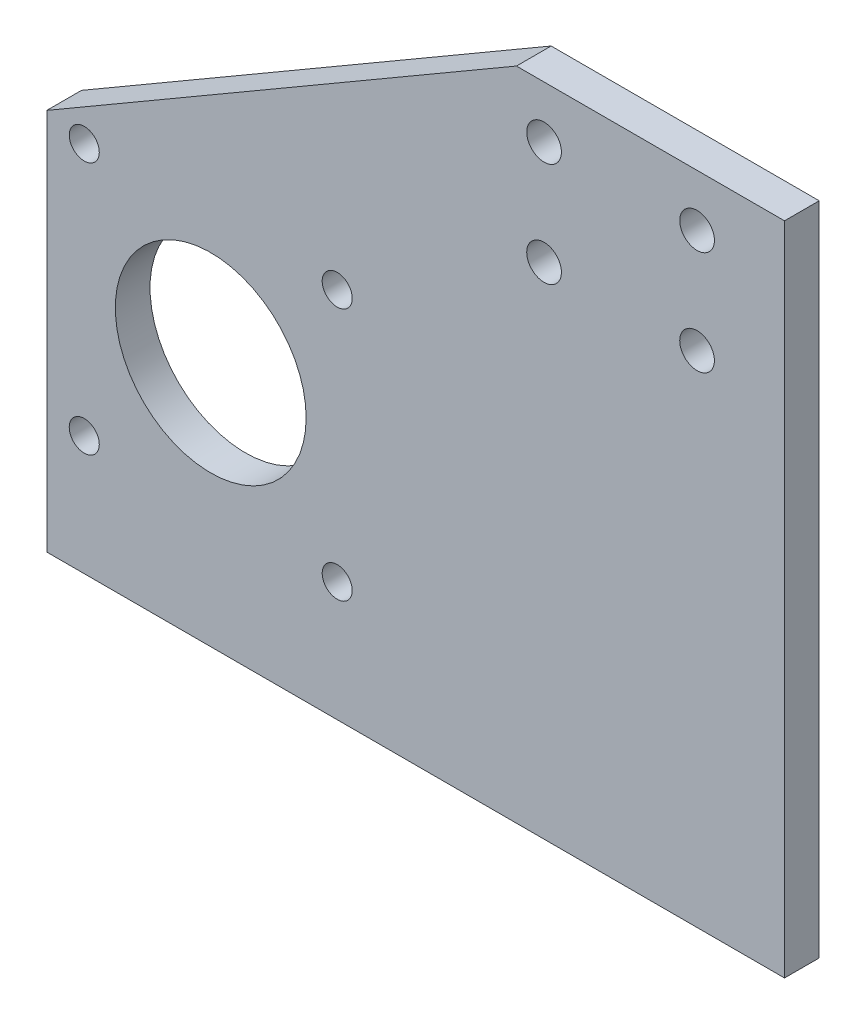
ISO-10303-21;
HEADER;
FILE_DESCRIPTION(('STEP AP214'),'2;1');
FILE_NAME('part.step','',(''),(''),'','','');
FILE_SCHEMA(('AUTOMOTIVE_DESIGN { 1 0 10303 214 1 1 1 1 }'));
ENDSEC;
DATA;
#1=APPLICATION_CONTEXT('core data for automotive mechanical design processes');
#2=APPLICATION_PROTOCOL_DEFINITION('international standard','automotive_design',2000,#1);
#3=PRODUCT_CONTEXT('',#1,'mechanical');
#4=PRODUCT('Part','Part','',(#3));
#5=PRODUCT_RELATED_PRODUCT_CATEGORY('part','',(#4));
#6=PRODUCT_DEFINITION_FORMATION('','',#4);
#7=PRODUCT_DEFINITION_CONTEXT('part definition',#1,'design');
#8=PRODUCT_DEFINITION('design','',#6,#7);
#9=PRODUCT_DEFINITION_SHAPE('','',#8);
#10=(LENGTH_UNIT() NAMED_UNIT(*) SI_UNIT(.MILLI.,.METRE.));
#11=(NAMED_UNIT(*) PLANE_ANGLE_UNIT() SI_UNIT($,.RADIAN.));
#12=(NAMED_UNIT(*) SI_UNIT($,.STERADIAN.) SOLID_ANGLE_UNIT());
#13=UNCERTAINTY_MEASURE_WITH_UNIT(LENGTH_MEASURE(1.E-05),#10,'distance_accuracy_value','');
#14=(GEOMETRIC_REPRESENTATION_CONTEXT(3) GLOBAL_UNCERTAINTY_ASSIGNED_CONTEXT((#13)) GLOBAL_UNIT_ASSIGNED_CONTEXT((#10,
#11,#12)) REPRESENTATION_CONTEXT('',''));
#15=CARTESIAN_POINT('',(0.,0.,0.));
#16=DIRECTION('',(0.,0.,1.));
#17=DIRECTION('',(1.,0.,0.));
#18=AXIS2_PLACEMENT_3D('',#15,#16,#17);
#19=CARTESIAN_POINT('',(0.,0.,6.35));
#20=DIRECTION('',(0.,0.,1.));
#21=DIRECTION('',(1.,0.,0.));
#22=AXIS2_PLACEMENT_3D('',#19,#20,#21);
#23=PLANE('',#22);
#24=CARTESIAN_POINT('',(-105.,45.,6.35));
#25=DIRECTION('',(0.,0.,1.));
#26=DIRECTION('',(1.,0.,0.));
#27=AXIS2_PLACEMENT_3D('',#24,#25,#26);
#28=CIRCLE('',#27,17.4625);
#29=CARTESIAN_POINT('',(-87.5375,45.,6.35));
#30=VERTEX_POINT('',#29);
#31=EDGE_CURVE('E285',#30,#30,#28,.T.);
#32=ORIENTED_EDGE('',*,*,#31,.F.);
#33=EDGE_LOOP('',(#32));
#34=FACE_BOUND('',#33,.T.);
#35=CARTESIAN_POINT('',(-81.855,68.15,6.35));
#36=DIRECTION('',(0.,0.,1.));
#37=DIRECTION('',(-1.,0.,0.));
#38=AXIS2_PLACEMENT_3D('',#35,#36,#37);
#39=CIRCLE('',#38,2.75000000000001);
#40=CARTESIAN_POINT('',(-84.605,68.15,6.35));
#41=VERTEX_POINT('',#40);
#42=EDGE_CURVE('E286',#41,#41,#39,.T.);
#43=ORIENTED_EDGE('',*,*,#42,.F.);
#44=EDGE_LOOP('',(#43));
#45=FACE_BOUND('',#44,.T.);
#46=CARTESIAN_POINT('',(-81.855,21.85,6.35));
#47=DIRECTION('',(0.,0.,1.));
#48=DIRECTION('',(1.,0.,0.));
#49=AXIS2_PLACEMENT_3D('',#46,#47,#48);
#50=CIRCLE('',#49,2.75000000000001);
#51=CARTESIAN_POINT('',(-79.105,21.85,6.35));
#52=VERTEX_POINT('',#51);
#53=EDGE_CURVE('E289',#52,#52,#50,.T.);
#54=ORIENTED_EDGE('',*,*,#53,.F.);
#55=EDGE_LOOP('',(#54));
#56=FACE_BOUND('',#55,.T.);
#57=CARTESIAN_POINT('',(-128.145,21.85,6.35));
#58=DIRECTION('',(0.,0.,1.));
#59=DIRECTION('',(-1.,0.,0.));
#60=AXIS2_PLACEMENT_3D('',#57,#58,#59);
#61=CIRCLE('',#60,2.75000000000001);
#62=CARTESIAN_POINT('',(-130.895,21.85,6.35));
#63=VERTEX_POINT('',#62);
#64=EDGE_CURVE('E293',#63,#63,#61,.T.);
#65=ORIENTED_EDGE('',*,*,#64,.F.);
#66=EDGE_LOOP('',(#65));
#67=FACE_BOUND('',#66,.T.);
#68=CARTESIAN_POINT('',(-128.145,68.15,6.35));
#69=DIRECTION('',(0.,0.,1.));
#70=DIRECTION('',(1.,0.,0.));
#71=AXIS2_PLACEMENT_3D('',#68,#69,#70);
#72=CIRCLE('',#71,2.75000000000001);
#73=CARTESIAN_POINT('',(-125.395,68.15,6.35));
#74=VERTEX_POINT('',#73);
#75=EDGE_CURVE('E130',#74,#74,#72,.T.);
#76=ORIENTED_EDGE('',*,*,#75,.F.);
#77=EDGE_LOOP('',(#76));
#78=FACE_BOUND('',#77,.T.);
#79=CARTESIAN_POINT('',(-16.,91.425,6.35));
#80=DIRECTION('',(0.,0.,1.));
#81=DIRECTION('',(-1.,0.,0.));
#82=AXIS2_PLACEMENT_3D('',#79,#80,#81);
#83=CIRCLE('',#82,3.175);
#84=CARTESIAN_POINT('',(-19.175,91.425,6.35));
#85=VERTEX_POINT('',#84);
#86=EDGE_CURVE('E153',#85,#85,#83,.T.);
#87=ORIENTED_EDGE('',*,*,#86,.F.);
#88=EDGE_LOOP('',(#87));
#89=FACE_BOUND('',#88,.T.);
#90=CARTESIAN_POINT('',(-44.,110.475,6.35));
#91=DIRECTION('',(0.,0.,1.));
#92=DIRECTION('',(1.,0.,0.));
#93=AXIS2_PLACEMENT_3D('',#90,#91,#92);
#94=CIRCLE('',#93,3.175);
#95=CARTESIAN_POINT('',(-40.825,110.475,6.35));
#96=VERTEX_POINT('',#95);
#97=EDGE_CURVE('E117',#96,#96,#94,.T.);
#98=ORIENTED_EDGE('',*,*,#97,.F.);
#99=EDGE_LOOP('',(#98));
#100=FACE_BOUND('',#99,.T.);
#101=DIRECTION('',(0.,1.,0.));
#102=VECTOR('',#101,1.);
#103=CARTESIAN_POINT('',(0.,0.,6.35));
#104=LINE('',#103,#102);
#105=CARTESIAN_POINT('',(0.,0.,6.35));
#106=VERTEX_POINT('',#105);
#107=CARTESIAN_POINT('',(0.,120.,6.35));
#108=VERTEX_POINT('',#107);
#109=EDGE_CURVE('E122',#106,#108,#104,.T.);
#110=ORIENTED_EDGE('',*,*,#109,.T.);
#111=DIRECTION('',(-1.,0.,0.));
#112=VECTOR('',#111,1.);
#113=CARTESIAN_POINT('',(0.,120.,6.35));
#114=LINE('',#113,#112);
#115=CARTESIAN_POINT('',(-49.0560754427998,120.,6.35));
#116=VERTEX_POINT('',#115);
#117=EDGE_CURVE('E89',#108,#116,#114,.T.);
#118=ORIENTED_EDGE('',*,*,#117,.T.);
#119=DIRECTION('',(-0.864364678199632,-0.502865492036236,0.));
#120=VECTOR('',#119,1.);
#121=CARTESIAN_POINT('',(-135.,70.,6.35));
#122=LINE('',#121,#120);
#123=CARTESIAN_POINT('',(-135.,70.,6.35));
#124=VERTEX_POINT('',#123);
#125=EDGE_CURVE('E93',#116,#124,#122,.T.);
#126=ORIENTED_EDGE('',*,*,#125,.T.);
#127=DIRECTION('',(0.,-1.,0.));
#128=VECTOR('',#127,1.);
#129=CARTESIAN_POINT('',(-135.,0.,6.35));
#130=LINE('',#129,#128);
#131=CARTESIAN_POINT('',(-135.,0.,6.35));
#132=VERTEX_POINT('',#131);
#133=EDGE_CURVE('E97',#124,#132,#130,.T.);
#134=ORIENTED_EDGE('',*,*,#133,.T.);
#135=DIRECTION('',(1.,0.,0.));
#136=VECTOR('',#135,1.);
#137=CARTESIAN_POINT('',(0.,0.,6.35));
#138=LINE('',#137,#136);
#139=EDGE_CURVE('E55',#132,#106,#138,.T.);
#140=ORIENTED_EDGE('',*,*,#139,.T.);
#141=EDGE_LOOP('',(#110,#118,#126,#134,#140));
#142=FACE_BOUND('',#141,.T.);
#143=CARTESIAN_POINT('',(-16.,110.475,6.35));
#144=DIRECTION('',(0.,0.,1.));
#145=DIRECTION('',(1.,0.,0.));
#146=AXIS2_PLACEMENT_3D('',#143,#144,#145);
#147=CIRCLE('',#146,3.175);
#148=CARTESIAN_POINT('',(-12.825,110.475,6.35));
#149=VERTEX_POINT('',#148);
#150=EDGE_CURVE('E159',#149,#149,#147,.T.);
#151=ORIENTED_EDGE('',*,*,#150,.F.);
#152=EDGE_LOOP('',(#151));
#153=FACE_BOUND('',#152,.T.);
#154=CARTESIAN_POINT('',(-44.,91.425,6.35));
#155=DIRECTION('',(0.,0.,1.));
#156=DIRECTION('',(-1.,0.,0.));
#157=AXIS2_PLACEMENT_3D('',#154,#155,#156);
#158=CIRCLE('',#157,3.175);
#159=CARTESIAN_POINT('',(-47.175,91.425,6.35));
#160=VERTEX_POINT('',#159);
#161=EDGE_CURVE('E144',#160,#160,#158,.T.);
#162=ORIENTED_EDGE('',*,*,#161,.F.);
#163=EDGE_LOOP('',(#162));
#164=FACE_BOUND('',#163,.T.);
#165=ADVANCED_FACE('F36',(#34,#45,#56,#67,#78,#89,#100,#142,#153,#164),#23,.T.);
#166=CARTESIAN_POINT('',(0.,0.,0.));
#167=DIRECTION('',(0.,0.,1.));
#168=DIRECTION('',(1.,0.,0.));
#169=AXIS2_PLACEMENT_3D('',#166,#167,#168);
#170=PLANE('',#169);
#171=CARTESIAN_POINT('',(-105.,45.,0.));
#172=DIRECTION('',(0.,0.,1.));
#173=DIRECTION('',(1.,0.,0.));
#174=AXIS2_PLACEMENT_3D('',#171,#172,#173);
#175=CIRCLE('',#174,17.4625);
#176=CARTESIAN_POINT('',(-87.5375,45.,0.));
#177=VERTEX_POINT('',#176);
#178=EDGE_CURVE('E40',#177,#177,#175,.T.);
#179=ORIENTED_EDGE('',*,*,#178,.T.);
#180=EDGE_LOOP('',(#179));
#181=FACE_BOUND('',#180,.T.);
#182=CARTESIAN_POINT('',(-81.855,68.15,0.));
#183=DIRECTION('',(0.,0.,1.));
#184=DIRECTION('',(1.,0.,0.));
#185=AXIS2_PLACEMENT_3D('',#182,#183,#184);
#186=CIRCLE('',#185,2.75000000000001);
#187=CARTESIAN_POINT('',(-79.105,68.15,0.));
#188=VERTEX_POINT('',#187);
#189=EDGE_CURVE('E135',#188,#188,#186,.T.);
#190=ORIENTED_EDGE('',*,*,#189,.T.);
#191=EDGE_LOOP('',(#190));
#192=FACE_BOUND('',#191,.T.);
#193=CARTESIAN_POINT('',(-81.855,21.85,0.));
#194=DIRECTION('',(0.,0.,1.));
#195=DIRECTION('',(1.,0.,0.));
#196=AXIS2_PLACEMENT_3D('',#193,#194,#195);
#197=CIRCLE('',#196,2.75000000000001);
#198=CARTESIAN_POINT('',(-79.105,21.85,0.));
#199=VERTEX_POINT('',#198);
#200=EDGE_CURVE('E133',#199,#199,#197,.T.);
#201=ORIENTED_EDGE('',*,*,#200,.T.);
#202=EDGE_LOOP('',(#201));
#203=FACE_BOUND('',#202,.T.);
#204=CARTESIAN_POINT('',(-128.145,21.85,0.));
#205=DIRECTION('',(0.,0.,1.));
#206=DIRECTION('',(1.,0.,0.));
#207=AXIS2_PLACEMENT_3D('',#204,#205,#206);
#208=CIRCLE('',#207,2.75000000000001);
#209=CARTESIAN_POINT('',(-125.395,21.85,0.));
#210=VERTEX_POINT('',#209);
#211=EDGE_CURVE('E129',#210,#210,#208,.T.);
#212=ORIENTED_EDGE('',*,*,#211,.T.);
#213=EDGE_LOOP('',(#212));
#214=FACE_BOUND('',#213,.T.);
#215=CARTESIAN_POINT('',(-128.145,68.15,0.));
#216=DIRECTION('',(0.,0.,1.));
#217=DIRECTION('',(1.,0.,0.));
#218=AXIS2_PLACEMENT_3D('',#215,#216,#217);
#219=CIRCLE('',#218,2.75000000000001);
#220=CARTESIAN_POINT('',(-125.395,68.15,0.));
#221=VERTEX_POINT('',#220);
#222=EDGE_CURVE('E126',#221,#221,#219,.T.);
#223=ORIENTED_EDGE('',*,*,#222,.T.);
#224=EDGE_LOOP('',(#223));
#225=FACE_BOUND('',#224,.T.);
#226=DIRECTION('',(0.,1.,0.));
#227=VECTOR('',#226,1.);
#228=CARTESIAN_POINT('',(0.,0.,0.));
#229=LINE('',#228,#227);
#230=CARTESIAN_POINT('',(0.,0.,0.));
#231=VERTEX_POINT('',#230);
#232=CARTESIAN_POINT('',(0.,120.,0.));
#233=VERTEX_POINT('',#232);
#234=EDGE_CURVE('E113',#231,#233,#229,.T.);
#235=ORIENTED_EDGE('',*,*,#234,.F.);
#236=DIRECTION('',(1.,0.,0.));
#237=VECTOR('',#236,1.);
#238=CARTESIAN_POINT('',(0.,0.,0.));
#239=LINE('',#238,#237);
#240=CARTESIAN_POINT('',(-135.,0.,0.));
#241=VERTEX_POINT('',#240);
#242=EDGE_CURVE('E81',#241,#231,#239,.T.);
#243=ORIENTED_EDGE('',*,*,#242,.F.);
#244=DIRECTION('',(0.,-1.,0.));
#245=VECTOR('',#244,1.);
#246=CARTESIAN_POINT('',(-135.,0.,0.));
#247=LINE('',#246,#245);
#248=CARTESIAN_POINT('',(-135.,70.,0.));
#249=VERTEX_POINT('',#248);
#250=EDGE_CURVE('E75',#249,#241,#247,.T.);
#251=ORIENTED_EDGE('',*,*,#250,.F.);
#252=DIRECTION('',(-0.864364678199632,-0.502865492036236,0.));
#253=VECTOR('',#252,1.);
#254=CARTESIAN_POINT('',(-135.,70.,0.));
#255=LINE('',#254,#253);
#256=CARTESIAN_POINT('',(-49.0560754427998,120.,0.));
#257=VERTEX_POINT('',#256);
#258=EDGE_CURVE('E104',#257,#249,#255,.T.);
#259=ORIENTED_EDGE('',*,*,#258,.F.);
#260=DIRECTION('',(-1.,0.,0.));
#261=VECTOR('',#260,1.);
#262=CARTESIAN_POINT('',(0.,120.,0.));
#263=LINE('',#262,#261);
#264=EDGE_CURVE('E116',#233,#257,#263,.T.);
#265=ORIENTED_EDGE('',*,*,#264,.F.);
#266=EDGE_LOOP('',(#235,#243,#251,#259,#265));
#267=FACE_BOUND('',#266,.T.);
#268=CARTESIAN_POINT('',(-44.,110.475,0.));
#269=DIRECTION('',(0.,0.,1.));
#270=DIRECTION('',(1.,0.,0.));
#271=AXIS2_PLACEMENT_3D('',#268,#269,#270);
#272=CIRCLE('',#271,3.175);
#273=CARTESIAN_POINT('',(-40.825,110.475,0.));
#274=VERTEX_POINT('',#273);
#275=EDGE_CURVE('E162',#274,#274,#272,.T.);
#276=ORIENTED_EDGE('',*,*,#275,.T.);
#277=EDGE_LOOP('',(#276));
#278=FACE_BOUND('',#277,.T.);
#279=CARTESIAN_POINT('',(-16.,110.475,0.));
#280=DIRECTION('',(0.,0.,1.));
#281=DIRECTION('',(1.,0.,0.));
#282=AXIS2_PLACEMENT_3D('',#279,#280,#281);
#283=CIRCLE('',#282,3.175);
#284=CARTESIAN_POINT('',(-12.825,110.475,0.));
#285=VERTEX_POINT('',#284);
#286=EDGE_CURVE('E156',#285,#285,#283,.T.);
#287=ORIENTED_EDGE('',*,*,#286,.T.);
#288=EDGE_LOOP('',(#287));
#289=FACE_BOUND('',#288,.T.);
#290=CARTESIAN_POINT('',(-16.,91.425,0.));
#291=DIRECTION('',(0.,0.,1.));
#292=DIRECTION('',(-1.,0.,0.));
#293=AXIS2_PLACEMENT_3D('',#290,#291,#292);
#294=CIRCLE('',#293,3.175);
#295=CARTESIAN_POINT('',(-19.175,91.425,0.));
#296=VERTEX_POINT('',#295);
#297=EDGE_CURVE('E149',#296,#296,#294,.T.);
#298=ORIENTED_EDGE('',*,*,#297,.T.);
#299=EDGE_LOOP('',(#298));
#300=FACE_BOUND('',#299,.T.);
#301=CARTESIAN_POINT('',(-44.,91.425,0.));
#302=DIRECTION('',(0.,0.,1.));
#303=DIRECTION('',(-1.,0.,0.));
#304=AXIS2_PLACEMENT_3D('',#301,#302,#303);
#305=CIRCLE('',#304,3.175);
#306=CARTESIAN_POINT('',(-47.175,91.425,0.));
#307=VERTEX_POINT('',#306);
#308=EDGE_CURVE('E140',#307,#307,#305,.T.);
#309=ORIENTED_EDGE('',*,*,#308,.T.);
#310=EDGE_LOOP('',(#309));
#311=FACE_BOUND('',#310,.T.);
#312=ADVANCED_FACE('F175',(#181,#192,#203,#214,#225,#267,#278,#289,#300,#311),#170,.F.);
#313=CARTESIAN_POINT('',(0.,0.,6.35));
#314=DIRECTION('',(-1.,0.,0.));
#315=DIRECTION('',(0.,0.,1.));
#316=AXIS2_PLACEMENT_3D('',#313,#314,#315);
#317=PLANE('',#316);
#318=ORIENTED_EDGE('',*,*,#234,.T.);
#319=DIRECTION('',(0.,0.,-1.));
#320=VECTOR('',#319,1.);
#321=CARTESIAN_POINT('',(0.,120.,6.35));
#322=LINE('',#321,#320);
#323=EDGE_CURVE('E11',#108,#233,#322,.T.);
#324=ORIENTED_EDGE('',*,*,#323,.F.);
#325=ORIENTED_EDGE('',*,*,#109,.F.);
#326=DIRECTION('',(0.,0.,-1.));
#327=VECTOR('',#326,1.);
#328=CARTESIAN_POINT('',(0.,0.,6.35));
#329=LINE('',#328,#327);
#330=EDGE_CURVE('E109',#106,#231,#329,.T.);
#331=ORIENTED_EDGE('',*,*,#330,.T.);
#332=EDGE_LOOP('',(#318,#324,#325,#331));
#333=FACE_BOUND('',#332,.T.);
#334=ADVANCED_FACE('F38',(#333),#317,.F.);
#335=CARTESIAN_POINT('',(0.,120.,6.35));
#336=DIRECTION('',(0.,-1.,0.));
#337=DIRECTION('',(0.,0.,-1.));
#338=AXIS2_PLACEMENT_3D('',#335,#336,#337);
#339=PLANE('',#338);
#340=ORIENTED_EDGE('',*,*,#264,.T.);
#341=DIRECTION('',(0.,0.,-1.));
#342=VECTOR('',#341,1.);
#343=CARTESIAN_POINT('',(-49.0560754427998,120.,6.35));
#344=LINE('',#343,#342);
#345=EDGE_CURVE('E46',#116,#257,#344,.T.);
#346=ORIENTED_EDGE('',*,*,#345,.F.);
#347=ORIENTED_EDGE('',*,*,#117,.F.);
#348=ORIENTED_EDGE('',*,*,#323,.T.);
#349=EDGE_LOOP('',(#340,#346,#347,#348));
#350=FACE_BOUND('',#349,.T.);
#351=ADVANCED_FACE('F173',(#350),#339,.F.);
#352=CARTESIAN_POINT('',(-135.,70.,6.35));
#353=DIRECTION('',(0.502865492036236,-0.864364678199632,0.));
#354=DIRECTION('',(0.864364678199632,0.502865492036236,0.));
#355=AXIS2_PLACEMENT_3D('',#352,#353,#354);
#356=PLANE('',#355);
#357=ORIENTED_EDGE('',*,*,#258,.T.);
#358=DIRECTION('',(0.,0.,-1.));
#359=VECTOR('',#358,1.);
#360=CARTESIAN_POINT('',(-135.,70.,6.35));
#361=LINE('',#360,#359);
#362=EDGE_CURVE('E101',#124,#249,#361,.T.);
#363=ORIENTED_EDGE('',*,*,#362,.F.);
#364=ORIENTED_EDGE('',*,*,#125,.F.);
#365=ORIENTED_EDGE('',*,*,#345,.T.);
#366=EDGE_LOOP('',(#357,#363,#364,#365));
#367=FACE_BOUND('',#366,.T.);
#368=ADVANCED_FACE('F102',(#367),#356,.F.);
#369=CARTESIAN_POINT('',(-135.,0.,6.35));
#370=DIRECTION('',(1.,0.,0.));
#371=DIRECTION('',(0.,0.,-1.));
#372=AXIS2_PLACEMENT_3D('',#369,#370,#371);
#373=PLANE('',#372);
#374=ORIENTED_EDGE('',*,*,#250,.T.);
#375=DIRECTION('',(0.,0.,-1.));
#376=VECTOR('',#375,1.);
#377=CARTESIAN_POINT('',(-135.,0.,6.35));
#378=LINE('',#377,#376);
#379=EDGE_CURVE('E105',#132,#241,#378,.T.);
#380=ORIENTED_EDGE('',*,*,#379,.F.);
#381=ORIENTED_EDGE('',*,*,#133,.F.);
#382=ORIENTED_EDGE('',*,*,#362,.T.);
#383=EDGE_LOOP('',(#374,#380,#381,#382));
#384=FACE_BOUND('',#383,.T.);
#385=ADVANCED_FACE('F107',(#384),#373,.F.);
#386=CARTESIAN_POINT('',(0.,0.,6.35));
#387=DIRECTION('',(0.,1.,0.));
#388=DIRECTION('',(-1.,0.,0.));
#389=AXIS2_PLACEMENT_3D('',#386,#387,#388);
#390=PLANE('',#389);
#391=ORIENTED_EDGE('',*,*,#242,.T.);
#392=ORIENTED_EDGE('',*,*,#330,.F.);
#393=ORIENTED_EDGE('',*,*,#139,.F.);
#394=ORIENTED_EDGE('',*,*,#379,.T.);
#395=EDGE_LOOP('',(#391,#392,#393,#394));
#396=FACE_BOUND('',#395,.T.);
#397=ADVANCED_FACE('F210',(#396),#390,.F.);
#398=CARTESIAN_POINT('',(-44.,110.475,6.35));
#399=DIRECTION('',(0.,0.,-1.));
#400=DIRECTION('',(-1.,0.,0.));
#401=AXIS2_PLACEMENT_3D('',#398,#399,#400);
#402=CYLINDRICAL_SURFACE('',#401,3.175);
#403=ORIENTED_EDGE('',*,*,#97,.T.);
#404=EDGE_LOOP('',(#403));
#405=FACE_BOUND('',#404,.T.);
#406=ORIENTED_EDGE('',*,*,#275,.F.);
#407=EDGE_LOOP('',(#406));
#408=FACE_BOUND('',#407,.T.);
#409=ADVANCED_FACE('F198',(#405,#408),#402,.F.);
#410=CARTESIAN_POINT('',(-16.,110.475,6.35));
#411=DIRECTION('',(0.,0.,-1.));
#412=DIRECTION('',(-1.,0.,0.));
#413=AXIS2_PLACEMENT_3D('',#410,#411,#412);
#414=CYLINDRICAL_SURFACE('',#413,3.175);
#415=ORIENTED_EDGE('',*,*,#150,.T.);
#416=EDGE_LOOP('',(#415));
#417=FACE_BOUND('',#416,.T.);
#418=ORIENTED_EDGE('',*,*,#286,.F.);
#419=EDGE_LOOP('',(#418));
#420=FACE_BOUND('',#419,.T.);
#421=ADVANCED_FACE('F188',(#417,#420),#414,.F.);
#422=CARTESIAN_POINT('',(-16.,91.425,6.35));
#423=DIRECTION('',(0.,0.,-1.));
#424=DIRECTION('',(-1.,0.,0.));
#425=AXIS2_PLACEMENT_3D('',#422,#423,#424);
#426=CYLINDRICAL_SURFACE('',#425,3.175);
#427=ORIENTED_EDGE('',*,*,#86,.T.);
#428=EDGE_LOOP('',(#427));
#429=FACE_BOUND('',#428,.T.);
#430=ORIENTED_EDGE('',*,*,#297,.F.);
#431=EDGE_LOOP('',(#430));
#432=FACE_BOUND('',#431,.T.);
#433=ADVANCED_FACE('F185',(#429,#432),#426,.F.);
#434=CARTESIAN_POINT('',(-44.,91.425,6.35));
#435=DIRECTION('',(0.,0.,-1.));
#436=DIRECTION('',(-1.,0.,0.));
#437=AXIS2_PLACEMENT_3D('',#434,#435,#436);
#438=CYLINDRICAL_SURFACE('',#437,3.175);
#439=ORIENTED_EDGE('',*,*,#161,.T.);
#440=EDGE_LOOP('',(#439));
#441=FACE_BOUND('',#440,.T.);
#442=ORIENTED_EDGE('',*,*,#308,.F.);
#443=EDGE_LOOP('',(#442));
#444=FACE_BOUND('',#443,.T.);
#445=ADVANCED_FACE('F187',(#441,#444),#438,.F.);
#446=CARTESIAN_POINT('',(-128.145,68.15,-6.35));
#447=DIRECTION('',(0.,0.,1.));
#448=DIRECTION('',(1.,0.,0.));
#449=AXIS2_PLACEMENT_3D('',#446,#447,#448);
#450=CYLINDRICAL_SURFACE('',#449,2.75000000000001);
#451=ORIENTED_EDGE('',*,*,#75,.T.);
#452=EDGE_LOOP('',(#451));
#453=FACE_BOUND('',#452,.T.);
#454=ORIENTED_EDGE('',*,*,#222,.F.);
#455=EDGE_LOOP('',(#454));
#456=FACE_BOUND('',#455,.T.);
#457=ADVANCED_FACE('F195',(#453,#456),#450,.F.);
#458=CARTESIAN_POINT('',(-128.145,21.85,-6.35));
#459=DIRECTION('',(0.,0.,1.));
#460=DIRECTION('',(1.,0.,0.));
#461=AXIS2_PLACEMENT_3D('',#458,#459,#460);
#462=CYLINDRICAL_SURFACE('',#461,2.75000000000001);
#463=ORIENTED_EDGE('',*,*,#64,.T.);
#464=EDGE_LOOP('',(#463));
#465=FACE_BOUND('',#464,.T.);
#466=ORIENTED_EDGE('',*,*,#211,.F.);
#467=EDGE_LOOP('',(#466));
#468=FACE_BOUND('',#467,.T.);
#469=ADVANCED_FACE('F238',(#465,#468),#462,.F.);
#470=CARTESIAN_POINT('',(-81.855,21.85,-6.35));
#471=DIRECTION('',(0.,0.,1.));
#472=DIRECTION('',(1.,0.,0.));
#473=AXIS2_PLACEMENT_3D('',#470,#471,#472);
#474=CYLINDRICAL_SURFACE('',#473,2.75000000000001);
#475=ORIENTED_EDGE('',*,*,#53,.T.);
#476=EDGE_LOOP('',(#475));
#477=FACE_BOUND('',#476,.T.);
#478=ORIENTED_EDGE('',*,*,#200,.F.);
#479=EDGE_LOOP('',(#478));
#480=FACE_BOUND('',#479,.T.);
#481=ADVANCED_FACE('F249',(#477,#480),#474,.F.);
#482=CARTESIAN_POINT('',(-81.855,68.15,-6.35));
#483=DIRECTION('',(0.,0.,1.));
#484=DIRECTION('',(1.,0.,0.));
#485=AXIS2_PLACEMENT_3D('',#482,#483,#484);
#486=CYLINDRICAL_SURFACE('',#485,2.75000000000001);
#487=ORIENTED_EDGE('',*,*,#42,.T.);
#488=EDGE_LOOP('',(#487));
#489=FACE_BOUND('',#488,.T.);
#490=ORIENTED_EDGE('',*,*,#189,.F.);
#491=EDGE_LOOP('',(#490));
#492=FACE_BOUND('',#491,.T.);
#493=ADVANCED_FACE('F259',(#489,#492),#486,.F.);
#494=CARTESIAN_POINT('',(-105.,45.,-6.35));
#495=DIRECTION('',(0.,0.,1.));
#496=DIRECTION('',(1.,0.,0.));
#497=AXIS2_PLACEMENT_3D('',#494,#495,#496);
#498=CYLINDRICAL_SURFACE('',#497,17.4625);
#499=ORIENTED_EDGE('',*,*,#31,.T.);
#500=EDGE_LOOP('',(#499));
#501=FACE_BOUND('',#500,.T.);
#502=ORIENTED_EDGE('',*,*,#178,.F.);
#503=EDGE_LOOP('',(#502));
#504=FACE_BOUND('',#503,.T.);
#505=ADVANCED_FACE('F269',(#501,#504),#498,.F.);
#506=CLOSED_SHELL('',(#165,#312,#334,#351,#368,#385,#397,#409,#421,#433,#445,#457,#469,#481,
#493,#505));
#507=MANIFOLD_SOLID_BREP('B2',#506);
#508=ADVANCED_BREP_SHAPE_REPRESENTATION('',(#18,#507),#14);
#509=SHAPE_DEFINITION_REPRESENTATION(#9,#508);
ENDSEC;
END-ISO-10303-21;
